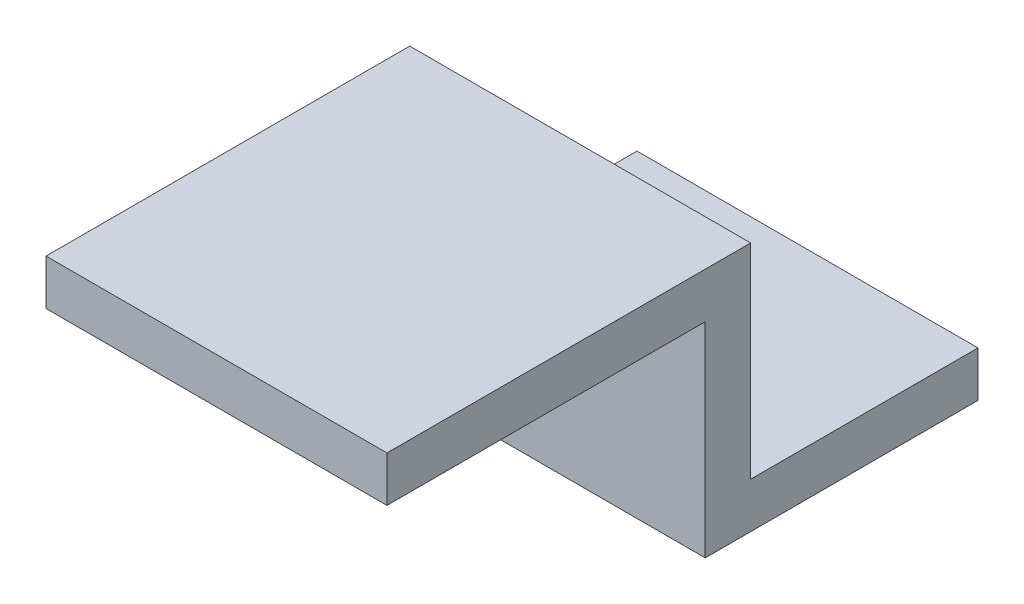
ISO-10303-21;
HEADER;
FILE_DESCRIPTION(('STEP AP214'),'2;1');
FILE_NAME('part.step','',(''),(''),'','','');
FILE_SCHEMA(('AUTOMOTIVE_DESIGN { 1 0 10303 214 1 1 1 1 }'));
ENDSEC;
DATA;
#1=APPLICATION_CONTEXT('core data for automotive mechanical design processes');
#2=APPLICATION_PROTOCOL_DEFINITION('international standard','automotive_design',2000,#1);
#3=PRODUCT_CONTEXT('',#1,'mechanical');
#4=PRODUCT('Part','Part','',(#3));
#5=PRODUCT_RELATED_PRODUCT_CATEGORY('part','',(#4));
#6=PRODUCT_DEFINITION_FORMATION('','',#4);
#7=PRODUCT_DEFINITION_CONTEXT('part definition',#1,'design');
#8=PRODUCT_DEFINITION('design','',#6,#7);
#9=PRODUCT_DEFINITION_SHAPE('','',#8);
#10=(LENGTH_UNIT() NAMED_UNIT(*) SI_UNIT(.MILLI.,.METRE.));
#11=(NAMED_UNIT(*) PLANE_ANGLE_UNIT() SI_UNIT($,.RADIAN.));
#12=(NAMED_UNIT(*) SI_UNIT($,.STERADIAN.) SOLID_ANGLE_UNIT());
#13=UNCERTAINTY_MEASURE_WITH_UNIT(LENGTH_MEASURE(1.E-05),#10,'distance_accuracy_value','');
#14=(GEOMETRIC_REPRESENTATION_CONTEXT(3) GLOBAL_UNCERTAINTY_ASSIGNED_CONTEXT((#13)) GLOBAL_UNIT_ASSIGNED_CONTEXT((#10,
#11,#12)) REPRESENTATION_CONTEXT('',''));
#15=CARTESIAN_POINT('',(0.,0.,0.));
#16=DIRECTION('',(0.,0.,1.));
#17=DIRECTION('',(1.,0.,0.));
#18=AXIS2_PLACEMENT_3D('',#15,#16,#17);
#19=CARTESIAN_POINT('',(-15.,-2.,0.));
#20=DIRECTION('',(0.,0.,1.));
#21=DIRECTION('',(1.,0.,0.));
#22=AXIS2_PLACEMENT_3D('',#19,#20,#21);
#23=PLANE('',#22);
#24=DIRECTION('',(0.,-1.,0.));
#25=VECTOR('',#24,1.);
#26=CARTESIAN_POINT('',(0.,-2.,0.));
#27=LINE('',#26,#25);
#28=CARTESIAN_POINT('',(0.,0.,0.));
#29=VERTEX_POINT('',#28);
#30=CARTESIAN_POINT('',(0.,-2.,0.));
#31=VERTEX_POINT('',#30);
#32=EDGE_CURVE('E130',#29,#31,#27,.T.);
#33=ORIENTED_EDGE('',*,*,#32,.F.);
#34=DIRECTION('',(1.,0.,0.));
#35=VECTOR('',#34,1.);
#36=CARTESIAN_POINT('',(-15.,0.,0.));
#37=LINE('',#36,#35);
#38=CARTESIAN_POINT('',(-15.,0.,0.));
#39=VERTEX_POINT('',#38);
#40=EDGE_CURVE('E11',#39,#29,#37,.T.);
#41=ORIENTED_EDGE('',*,*,#40,.F.);
#42=DIRECTION('',(0.,-1.,0.));
#43=VECTOR('',#42,1.);
#44=CARTESIAN_POINT('',(-15.,-2.,0.));
#45=LINE('',#44,#43);
#46=CARTESIAN_POINT('',(-15.,-2.,0.));
#47=VERTEX_POINT('',#46);
#48=EDGE_CURVE('E151',#39,#47,#45,.T.);
#49=ORIENTED_EDGE('',*,*,#48,.T.);
#50=DIRECTION('',(1.,0.,0.));
#51=VECTOR('',#50,1.);
#52=CARTESIAN_POINT('',(-15.,-2.,0.));
#53=LINE('',#52,#51);
#54=EDGE_CURVE('E36',#47,#31,#53,.T.);
#55=ORIENTED_EDGE('',*,*,#54,.T.);
#56=EDGE_LOOP('',(#33,#41,#49,#55));
#57=FACE_BOUND('',#56,.T.);
#58=ADVANCED_FACE('F33',(#57),#23,.T.);
#59=CARTESIAN_POINT('',(-15.,0.,0.));
#60=DIRECTION('',(0.,1.,0.));
#61=DIRECTION('',(0.,0.,1.));
#62=AXIS2_PLACEMENT_3D('',#59,#60,#61);
#63=PLANE('',#62);
#64=DIRECTION('',(0.,0.,1.));
#65=VECTOR('',#64,1.);
#66=CARTESIAN_POINT('',(0.,0.,0.));
#67=LINE('',#66,#65);
#68=CARTESIAN_POINT('',(0.,0.,-16.));
#69=VERTEX_POINT('',#68);
#70=EDGE_CURVE('E149',#69,#29,#67,.T.);
#71=ORIENTED_EDGE('',*,*,#70,.F.);
#72=DIRECTION('',(1.,0.,0.));
#73=VECTOR('',#72,1.);
#74=CARTESIAN_POINT('',(-15.,0.,-16.));
#75=LINE('',#74,#73);
#76=CARTESIAN_POINT('',(-15.,0.,-16.));
#77=VERTEX_POINT('',#76);
#78=EDGE_CURVE('E42',#77,#69,#75,.T.);
#79=ORIENTED_EDGE('',*,*,#78,.F.);
#80=DIRECTION('',(0.,0.,1.));
#81=VECTOR('',#80,1.);
#82=CARTESIAN_POINT('',(-15.,0.,0.));
#83=LINE('',#82,#81);
#84=EDGE_CURVE('E120',#77,#39,#83,.T.);
#85=ORIENTED_EDGE('',*,*,#84,.T.);
#86=ORIENTED_EDGE('',*,*,#40,.T.);
#87=EDGE_LOOP('',(#71,#79,#85,#86));
#88=FACE_BOUND('',#87,.T.);
#89=ADVANCED_FACE('F163',(#88),#63,.T.);
#90=CARTESIAN_POINT('',(-15.,0.,-16.));
#91=DIRECTION('',(0.,0.,-1.));
#92=DIRECTION('',(-1.,0.,0.));
#93=AXIS2_PLACEMENT_3D('',#90,#91,#92);
#94=PLANE('',#93);
#95=DIRECTION('',(0.,1.,0.));
#96=VECTOR('',#95,1.);
#97=CARTESIAN_POINT('',(0.,0.,-16.));
#98=LINE('',#97,#96);
#99=CARTESIAN_POINT('',(0.,-9.,-16.));
#100=VERTEX_POINT('',#99);
#101=EDGE_CURVE('E107',#100,#69,#98,.T.);
#102=ORIENTED_EDGE('',*,*,#101,.F.);
#103=DIRECTION('',(1.,0.,0.));
#104=VECTOR('',#103,1.);
#105=CARTESIAN_POINT('',(-15.,-9.,-16.));
#106=LINE('',#105,#104);
#107=CARTESIAN_POINT('',(-15.,-9.,-16.));
#108=VERTEX_POINT('',#107);
#109=EDGE_CURVE('E102',#108,#100,#106,.T.);
#110=ORIENTED_EDGE('',*,*,#109,.F.);
#111=DIRECTION('',(0.,1.,0.));
#112=VECTOR('',#111,1.);
#113=CARTESIAN_POINT('',(-15.,0.,-16.));
#114=LINE('',#113,#112);
#115=EDGE_CURVE('E105',#108,#77,#114,.T.);
#116=ORIENTED_EDGE('',*,*,#115,.T.);
#117=ORIENTED_EDGE('',*,*,#78,.T.);
#118=EDGE_LOOP('',(#102,#110,#116,#117));
#119=FACE_BOUND('',#118,.T.);
#120=ADVANCED_FACE('F104',(#119),#94,.T.);
#121=CARTESIAN_POINT('',(-15.,-9.,-16.));
#122=DIRECTION('',(0.,1.,0.));
#123=DIRECTION('',(0.,0.,1.));
#124=AXIS2_PLACEMENT_3D('',#121,#122,#123);
#125=PLANE('',#124);
#126=CARTESIAN_POINT('',(-7.5,-9.,-21.));
#127=DIRECTION('',(0.,1.,0.));
#128=DIRECTION('',(0.,0.,1.));
#129=AXIS2_PLACEMENT_3D('',#126,#127,#128);
#130=CIRCLE('',#129,1.5);
#131=CARTESIAN_POINT('',(-7.5,-9.,-19.5));
#132=VERTEX_POINT('',#131);
#133=EDGE_CURVE('E134',#132,#132,#130,.T.);
#134=ORIENTED_EDGE('',*,*,#133,.F.);
#135=EDGE_LOOP('',(#134));
#136=FACE_BOUND('',#135,.T.);
#137=DIRECTION('',(0.,0.,1.));
#138=VECTOR('',#137,1.);
#139=CARTESIAN_POINT('',(0.,-9.,-16.));
#140=LINE('',#139,#138);
#141=CARTESIAN_POINT('',(0.,-9.,-26.));
#142=VERTEX_POINT('',#141);
#143=EDGE_CURVE('E146',#142,#100,#140,.T.);
#144=ORIENTED_EDGE('',*,*,#143,.F.);
#145=DIRECTION('',(1.,0.,0.));
#146=VECTOR('',#145,1.);
#147=CARTESIAN_POINT('',(-15.,-9.,-26.));
#148=LINE('',#147,#146);
#149=CARTESIAN_POINT('',(-15.,-9.,-26.));
#150=VERTEX_POINT('',#149);
#151=EDGE_CURVE('E112',#150,#142,#148,.T.);
#152=ORIENTED_EDGE('',*,*,#151,.F.);
#153=DIRECTION('',(0.,0.,1.));
#154=VECTOR('',#153,1.);
#155=CARTESIAN_POINT('',(-15.,-9.,-16.));
#156=LINE('',#155,#154);
#157=EDGE_CURVE('E118',#150,#108,#156,.T.);
#158=ORIENTED_EDGE('',*,*,#157,.T.);
#159=ORIENTED_EDGE('',*,*,#109,.T.);
#160=EDGE_LOOP('',(#144,#152,#158,#159));
#161=FACE_BOUND('',#160,.T.);
#162=ADVANCED_FACE('F122',(#136,#161),#125,.T.);
#163=CARTESIAN_POINT('',(-15.,-9.,-26.));
#164=DIRECTION('',(0.,0.,-1.));
#165=DIRECTION('',(0.,1.,0.));
#166=AXIS2_PLACEMENT_3D('',#163,#164,#165);
#167=PLANE('',#166);
#168=DIRECTION('',(0.,1.,0.));
#169=VECTOR('',#168,1.);
#170=CARTESIAN_POINT('',(0.,-9.,-26.));
#171=LINE('',#170,#169);
#172=CARTESIAN_POINT('',(0.,-11.,-26.));
#173=VERTEX_POINT('',#172);
#174=EDGE_CURVE('E143',#173,#142,#171,.T.);
#175=ORIENTED_EDGE('',*,*,#174,.F.);
#176=DIRECTION('',(1.,0.,0.));
#177=VECTOR('',#176,1.);
#178=CARTESIAN_POINT('',(-15.,-11.,-26.));
#179=LINE('',#178,#177);
#180=CARTESIAN_POINT('',(-15.,-11.,-26.));
#181=VERTEX_POINT('',#180);
#182=EDGE_CURVE('E155',#181,#173,#179,.T.);
#183=ORIENTED_EDGE('',*,*,#182,.F.);
#184=DIRECTION('',(0.,1.,0.));
#185=VECTOR('',#184,1.);
#186=CARTESIAN_POINT('',(-15.,-9.,-26.));
#187=LINE('',#186,#185);
#188=EDGE_CURVE('E123',#181,#150,#187,.T.);
#189=ORIENTED_EDGE('',*,*,#188,.T.);
#190=ORIENTED_EDGE('',*,*,#151,.T.);
#191=EDGE_LOOP('',(#175,#183,#189,#190));
#192=FACE_BOUND('',#191,.T.);
#193=ADVANCED_FACE('F176',(#192),#167,.T.);
#194=CARTESIAN_POINT('',(-15.,-11.,-26.));
#195=DIRECTION('',(0.,-1.,0.));
#196=DIRECTION('',(0.,0.,-1.));
#197=AXIS2_PLACEMENT_3D('',#194,#195,#196);
#198=PLANE('',#197);
#199=CARTESIAN_POINT('',(-7.5,-11.,-21.));
#200=DIRECTION('',(0.,-1.,0.));
#201=DIRECTION('',(0.,0.,-1.));
#202=AXIS2_PLACEMENT_3D('',#199,#200,#201);
#203=CIRCLE('',#202,1.5);
#204=CARTESIAN_POINT('',(-7.5,-11.,-22.5));
#205=VERTEX_POINT('',#204);
#206=EDGE_CURVE('E204',#205,#205,#203,.F.);
#207=ORIENTED_EDGE('',*,*,#206,.T.);
#208=EDGE_LOOP('',(#207));
#209=FACE_BOUND('',#208,.T.);
#210=DIRECTION('',(0.,0.,-1.));
#211=VECTOR('',#210,1.);
#212=CARTESIAN_POINT('',(0.,-11.,-26.));
#213=LINE('',#212,#211);
#214=CARTESIAN_POINT('',(0.,-11.,-14.));
#215=VERTEX_POINT('',#214);
#216=EDGE_CURVE('E140',#215,#173,#213,.T.);
#217=ORIENTED_EDGE('',*,*,#216,.F.);
#218=DIRECTION('',(1.,0.,0.));
#219=VECTOR('',#218,1.);
#220=CARTESIAN_POINT('',(-15.,-11.,-14.));
#221=LINE('',#220,#219);
#222=CARTESIAN_POINT('',(-15.,-11.,-14.));
#223=VERTEX_POINT('',#222);
#224=EDGE_CURVE('E157',#223,#215,#221,.T.);
#225=ORIENTED_EDGE('',*,*,#224,.F.);
#226=DIRECTION('',(0.,0.,-1.));
#227=VECTOR('',#226,1.);
#228=CARTESIAN_POINT('',(-15.,-11.,-26.));
#229=LINE('',#228,#227);
#230=EDGE_CURVE('E125',#223,#181,#229,.T.);
#231=ORIENTED_EDGE('',*,*,#230,.T.);
#232=ORIENTED_EDGE('',*,*,#182,.T.);
#233=EDGE_LOOP('',(#217,#225,#231,#232));
#234=FACE_BOUND('',#233,.T.);
#235=ADVANCED_FACE('F180',(#209,#234),#198,.T.);
#236=CARTESIAN_POINT('',(-15.,-11.,-14.));
#237=DIRECTION('',(0.,0.,1.));
#238=DIRECTION('',(1.,0.,0.));
#239=AXIS2_PLACEMENT_3D('',#236,#237,#238);
#240=PLANE('',#239);
#241=DIRECTION('',(0.,-1.,0.));
#242=VECTOR('',#241,1.);
#243=CARTESIAN_POINT('',(0.,-11.,-14.));
#244=LINE('',#243,#242);
#245=CARTESIAN_POINT('',(0.,-2.,-14.));
#246=VERTEX_POINT('',#245);
#247=EDGE_CURVE('E137',#246,#215,#244,.T.);
#248=ORIENTED_EDGE('',*,*,#247,.F.);
#249=DIRECTION('',(1.,0.,0.));
#250=VECTOR('',#249,1.);
#251=CARTESIAN_POINT('',(-15.,-2.,-14.));
#252=LINE('',#251,#250);
#253=CARTESIAN_POINT('',(-15.,-2.,-14.));
#254=VERTEX_POINT('',#253);
#255=EDGE_CURVE('E158',#254,#246,#252,.T.);
#256=ORIENTED_EDGE('',*,*,#255,.F.);
#257=DIRECTION('',(0.,-1.,0.));
#258=VECTOR('',#257,1.);
#259=CARTESIAN_POINT('',(-15.,-11.,-14.));
#260=LINE('',#259,#258);
#261=EDGE_CURVE('E213',#254,#223,#260,.T.);
#262=ORIENTED_EDGE('',*,*,#261,.T.);
#263=ORIENTED_EDGE('',*,*,#224,.T.);
#264=EDGE_LOOP('',(#248,#256,#262,#263));
#265=FACE_BOUND('',#264,.T.);
#266=ADVANCED_FACE('F184',(#265),#240,.T.);
#267=CARTESIAN_POINT('',(-15.,-2.,-14.));
#268=DIRECTION('',(0.,-1.,0.));
#269=DIRECTION('',(0.,0.,-1.));
#270=AXIS2_PLACEMENT_3D('',#267,#268,#269);
#271=PLANE('',#270);
#272=DIRECTION('',(0.,0.,-1.));
#273=VECTOR('',#272,1.);
#274=CARTESIAN_POINT('',(0.,-2.,-14.));
#275=LINE('',#274,#273);
#276=EDGE_CURVE('E133',#31,#246,#275,.T.);
#277=ORIENTED_EDGE('',*,*,#276,.F.);
#278=ORIENTED_EDGE('',*,*,#54,.F.);
#279=DIRECTION('',(0.,0.,-1.));
#280=VECTOR('',#279,1.);
#281=CARTESIAN_POINT('',(-15.,-2.,-14.));
#282=LINE('',#281,#280);
#283=EDGE_CURVE('E211',#47,#254,#282,.T.);
#284=ORIENTED_EDGE('',*,*,#283,.T.);
#285=ORIENTED_EDGE('',*,*,#255,.T.);
#286=EDGE_LOOP('',(#277,#278,#284,#285));
#287=FACE_BOUND('',#286,.T.);
#288=ADVANCED_FACE('F160',(#287),#271,.T.);
#289=CARTESIAN_POINT('',(-15.,0.,0.));
#290=DIRECTION('',(-1.,0.,0.));
#291=DIRECTION('',(0.,0.,1.));
#292=AXIS2_PLACEMENT_3D('',#289,#290,#291);
#293=PLANE('',#292);
#294=ORIENTED_EDGE('',*,*,#48,.F.);
#295=ORIENTED_EDGE('',*,*,#84,.F.);
#296=ORIENTED_EDGE('',*,*,#115,.F.);
#297=ORIENTED_EDGE('',*,*,#157,.F.);
#298=ORIENTED_EDGE('',*,*,#188,.F.);
#299=ORIENTED_EDGE('',*,*,#230,.F.);
#300=ORIENTED_EDGE('',*,*,#261,.F.);
#301=ORIENTED_EDGE('',*,*,#283,.F.);
#302=EDGE_LOOP('',(#294,#295,#296,#297,#298,#299,#300,#301));
#303=FACE_BOUND('',#302,.T.);
#304=ADVANCED_FACE('F116',(#303),#293,.T.);
#305=CARTESIAN_POINT('',(0.,0.,0.));
#306=DIRECTION('',(-1.,0.,0.));
#307=DIRECTION('',(0.,0.,1.));
#308=AXIS2_PLACEMENT_3D('',#305,#306,#307);
#309=PLANE('',#308);
#310=ORIENTED_EDGE('',*,*,#32,.T.);
#311=ORIENTED_EDGE('',*,*,#276,.T.);
#312=ORIENTED_EDGE('',*,*,#247,.T.);
#313=ORIENTED_EDGE('',*,*,#216,.T.);
#314=ORIENTED_EDGE('',*,*,#174,.T.);
#315=ORIENTED_EDGE('',*,*,#143,.T.);
#316=ORIENTED_EDGE('',*,*,#101,.T.);
#317=ORIENTED_EDGE('',*,*,#70,.T.);
#318=EDGE_LOOP('',(#310,#311,#312,#313,#314,#315,#316,#317));
#319=FACE_BOUND('',#318,.T.);
#320=ADVANCED_FACE('F162',(#319),#309,.F.);
#321=CARTESIAN_POINT('',(-7.5,-11.001,-21.));
#322=DIRECTION('',(0.,1.,0.));
#323=DIRECTION('',(0.,0.,1.));
#324=AXIS2_PLACEMENT_3D('',#321,#322,#323);
#325=CYLINDRICAL_SURFACE('',#324,1.5);
#326=ORIENTED_EDGE('',*,*,#206,.F.);
#327=EDGE_LOOP('',(#326));
#328=FACE_BOUND('',#327,.T.);
#329=ORIENTED_EDGE('',*,*,#133,.T.);
#330=EDGE_LOOP('',(#329));
#331=FACE_BOUND('',#330,.T.);
#332=ADVANCED_FACE('F195',(#328,#331),#325,.F.);
#333=CLOSED_SHELL('',(#58,#89,#120,#162,#193,#235,#266,#288,#304,#320,#332));
#334=MANIFOLD_SOLID_BREP('B2',#333);
#335=ADVANCED_BREP_SHAPE_REPRESENTATION('',(#18,#334),#14);
#336=SHAPE_DEFINITION_REPRESENTATION(#9,#335);
ENDSEC;
END-ISO-10303-21;
